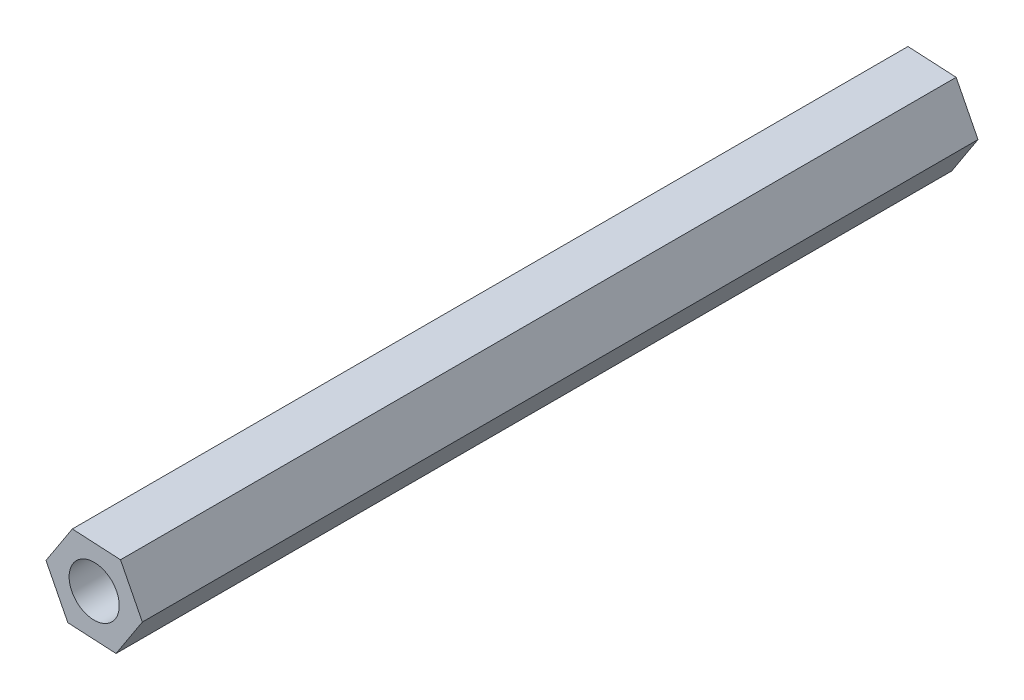
ISO-10303-21;
HEADER;
FILE_DESCRIPTION(('STEP AP214'),'2;1');
FILE_NAME('part.step','',(''),(''),'','','');
FILE_SCHEMA(('AUTOMOTIVE_DESIGN { 1 0 10303 214 1 1 1 1 }'));
ENDSEC;
DATA;
#1=APPLICATION_CONTEXT('core data for automotive mechanical design processes');
#2=APPLICATION_PROTOCOL_DEFINITION('international standard','automotive_design',2000,#1);
#3=PRODUCT_CONTEXT('',#1,'mechanical');
#4=PRODUCT('Part','Part','',(#3));
#5=PRODUCT_RELATED_PRODUCT_CATEGORY('part','',(#4));
#6=PRODUCT_DEFINITION_FORMATION('','',#4);
#7=PRODUCT_DEFINITION_CONTEXT('part definition',#1,'design');
#8=PRODUCT_DEFINITION('design','',#6,#7);
#9=PRODUCT_DEFINITION_SHAPE('','',#8);
#10=(LENGTH_UNIT() NAMED_UNIT(*) SI_UNIT(.MILLI.,.METRE.));
#11=(NAMED_UNIT(*) PLANE_ANGLE_UNIT() SI_UNIT($,.RADIAN.));
#12=(NAMED_UNIT(*) SI_UNIT($,.STERADIAN.) SOLID_ANGLE_UNIT());
#13=UNCERTAINTY_MEASURE_WITH_UNIT(LENGTH_MEASURE(1.E-05),#10,'distance_accuracy_value','');
#14=(GEOMETRIC_REPRESENTATION_CONTEXT(3) GLOBAL_UNCERTAINTY_ASSIGNED_CONTEXT((#13)) GLOBAL_UNIT_ASSIGNED_CONTEXT((#10,
#11,#12)) REPRESENTATION_CONTEXT('',''));
#15=CARTESIAN_POINT('',(0.,0.,0.));
#16=DIRECTION('',(0.,0.,1.));
#17=DIRECTION('',(1.,0.,0.));
#18=AXIS2_PLACEMENT_3D('',#15,#16,#17);
#19=CARTESIAN_POINT('',(2.8825916016709,-0.154916078280261,50.));
#20=DIRECTION('',(-0.891609732350342,-0.452804687672456,0.));
#21=DIRECTION('',(0.452804687672456,-0.891609732350342,0.));
#22=AXIS2_PLACEMENT_3D('',#19,#20,#21);
#23=PLANE('',#22);
#24=DIRECTION('',(-0.452804687672456,0.891609732350342,0.));
#25=VECTOR('',#24,1.);
#26=CARTESIAN_POINT('',(2.8825916016709,-0.154916078280261,0.));
#27=LINE('',#26,#25);
#28=CARTESIAN_POINT('',(2.8825916016709,-0.154916078280261,0.));
#29=VERTEX_POINT('',#28);
#30=CARTESIAN_POINT('',(1.57545706008081,2.41893951664254,0.));
#31=VERTEX_POINT('',#30);
#32=EDGE_CURVE('E115',#29,#31,#27,.T.);
#33=ORIENTED_EDGE('',*,*,#32,.T.);
#34=DIRECTION('',(0.,0.,-1.));
#35=VECTOR('',#34,1.);
#36=CARTESIAN_POINT('',(1.57545706008081,2.41893951664254,50.));
#37=LINE('',#36,#35);
#38=CARTESIAN_POINT('',(1.57545706008081,2.41893951664254,50.));
#39=VERTEX_POINT('',#38);
#40=EDGE_CURVE('E11',#39,#31,#37,.T.);
#41=ORIENTED_EDGE('',*,*,#40,.F.);
#42=DIRECTION('',(-0.452804687672456,0.891609732350342,0.));
#43=VECTOR('',#42,1.);
#44=CARTESIAN_POINT('',(2.8825916016709,-0.154916078280261,50.));
#45=LINE('',#44,#43);
#46=CARTESIAN_POINT('',(2.8825916016709,-0.154916078280261,50.));
#47=VERTEX_POINT('',#46);
#48=EDGE_CURVE('E126',#47,#39,#45,.T.);
#49=ORIENTED_EDGE('',*,*,#48,.F.);
#50=DIRECTION('',(0.,0.,-1.));
#51=VECTOR('',#50,1.);
#52=CARTESIAN_POINT('',(2.8825916016709,-0.154916078280261,50.));
#53=LINE('',#52,#51);
#54=EDGE_CURVE('E111',#47,#29,#53,.T.);
#55=ORIENTED_EDGE('',*,*,#54,.T.);
#56=EDGE_LOOP('',(#33,#41,#49,#55));
#57=FACE_BOUND('',#56,.T.);
#58=ADVANCED_FACE('F31',(#57),#23,.F.);
#59=CARTESIAN_POINT('',(1.57545706008081,2.41893951664254,50.));
#60=DIRECTION('',(-0.0536645036981452,-0.998559022313069,0.));
#61=DIRECTION('',(0.998559022313069,-0.0536645036981453,0.));
#62=AXIS2_PLACEMENT_3D('',#59,#60,#61);
#63=PLANE('',#62);
#64=DIRECTION('',(-0.998559022313069,0.0536645036981452,0.));
#65=VECTOR('',#64,1.);
#66=CARTESIAN_POINT('',(1.57545706008081,2.41893951664254,0.));
#67=LINE('',#66,#65);
#68=CARTESIAN_POINT('',(-1.30713454159008,2.5738555949228,0.));
#69=VERTEX_POINT('',#68);
#70=EDGE_CURVE('E118',#31,#69,#67,.T.);
#71=ORIENTED_EDGE('',*,*,#70,.T.);
#72=DIRECTION('',(0.,0.,-1.));
#73=VECTOR('',#72,1.);
#74=CARTESIAN_POINT('',(-1.30713454159008,2.5738555949228,50.));
#75=LINE('',#74,#73);
#76=CARTESIAN_POINT('',(-1.30713454159008,2.5738555949228,50.));
#77=VERTEX_POINT('',#76);
#78=EDGE_CURVE('E39',#77,#69,#75,.T.);
#79=ORIENTED_EDGE('',*,*,#78,.F.);
#80=DIRECTION('',(-0.998559022313069,0.0536645036981452,0.));
#81=VECTOR('',#80,1.);
#82=CARTESIAN_POINT('',(1.57545706008081,2.41893951664254,50.));
#83=LINE('',#82,#81);
#84=EDGE_CURVE('E84',#39,#77,#83,.T.);
#85=ORIENTED_EDGE('',*,*,#84,.F.);
#86=ORIENTED_EDGE('',*,*,#40,.T.);
#87=EDGE_LOOP('',(#71,#79,#85,#86));
#88=FACE_BOUND('',#87,.T.);
#89=ADVANCED_FACE('F151',(#88),#63,.F.);
#90=CARTESIAN_POINT('',(-1.30713454159008,2.5738555949228,50.));
#91=DIRECTION('',(0.837945228652197,-0.545754334640612,0.));
#92=DIRECTION('',(0.545754334640612,0.837945228652197,0.));
#93=AXIS2_PLACEMENT_3D('',#90,#91,#92);
#94=PLANE('',#93);
#95=DIRECTION('',(-0.545754334640612,-0.837945228652197,0.));
#96=VECTOR('',#95,1.);
#97=CARTESIAN_POINT('',(-1.30713454159008,2.5738555949228,0.));
#98=LINE('',#97,#96);
#99=CARTESIAN_POINT('',(-2.88259160167089,0.154916078280261,0.));
#100=VERTEX_POINT('',#99);
#101=EDGE_CURVE('E121',#69,#100,#98,.T.);
#102=ORIENTED_EDGE('',*,*,#101,.T.);
#103=DIRECTION('',(0.,0.,-1.));
#104=VECTOR('',#103,1.);
#105=CARTESIAN_POINT('',(-2.88259160167089,0.154916078280261,50.));
#106=LINE('',#105,#104);
#107=CARTESIAN_POINT('',(-2.88259160167089,0.154916078280261,50.));
#108=VERTEX_POINT('',#107);
#109=EDGE_CURVE('E106',#108,#100,#106,.T.);
#110=ORIENTED_EDGE('',*,*,#109,.F.);
#111=DIRECTION('',(-0.545754334640612,-0.837945228652197,0.));
#112=VECTOR('',#111,1.);
#113=CARTESIAN_POINT('',(-1.30713454159008,2.5738555949228,50.));
#114=LINE('',#113,#112);
#115=EDGE_CURVE('E97',#77,#108,#114,.T.);
#116=ORIENTED_EDGE('',*,*,#115,.F.);
#117=ORIENTED_EDGE('',*,*,#78,.T.);
#118=EDGE_LOOP('',(#102,#110,#116,#117));
#119=FACE_BOUND('',#118,.T.);
#120=ADVANCED_FACE('F132',(#119),#94,.F.);
#121=CARTESIAN_POINT('',(-2.88259160167089,0.154916078280261,50.));
#122=DIRECTION('',(0.891609732350343,0.452804687672456,0.));
#123=DIRECTION('',(-0.452804687672456,0.891609732350343,0.));
#124=AXIS2_PLACEMENT_3D('',#121,#122,#123);
#125=PLANE('',#124);
#126=DIRECTION('',(0.452804687672456,-0.891609732350343,0.));
#127=VECTOR('',#126,1.);
#128=CARTESIAN_POINT('',(-2.88259160167089,0.154916078280261,0.));
#129=LINE('',#128,#127);
#130=CARTESIAN_POINT('',(-1.57545706008081,-2.41893951664254,0.));
#131=VERTEX_POINT('',#130);
#132=EDGE_CURVE('E105',#100,#131,#129,.T.);
#133=ORIENTED_EDGE('',*,*,#132,.T.);
#134=DIRECTION('',(0.,0.,-1.));
#135=VECTOR('',#134,1.);
#136=CARTESIAN_POINT('',(-1.57545706008081,-2.41893951664254,50.));
#137=LINE('',#136,#135);
#138=CARTESIAN_POINT('',(-1.57545706008081,-2.41893951664254,50.));
#139=VERTEX_POINT('',#138);
#140=EDGE_CURVE('E102',#139,#131,#137,.T.);
#141=ORIENTED_EDGE('',*,*,#140,.F.);
#142=DIRECTION('',(0.452804687672456,-0.891609732350343,0.));
#143=VECTOR('',#142,1.);
#144=CARTESIAN_POINT('',(-2.88259160167089,0.154916078280261,50.));
#145=LINE('',#144,#143);
#146=EDGE_CURVE('E91',#108,#139,#145,.T.);
#147=ORIENTED_EDGE('',*,*,#146,.F.);
#148=ORIENTED_EDGE('',*,*,#109,.T.);
#149=EDGE_LOOP('',(#133,#141,#147,#148));
#150=FACE_BOUND('',#149,.T.);
#151=ADVANCED_FACE('F103',(#150),#125,.F.);
#152=CARTESIAN_POINT('',(-1.57545706008081,-2.41893951664254,50.));
#153=DIRECTION('',(0.0536645036981452,0.998559022313069,0.));
#154=DIRECTION('',(-0.998559022313069,0.0536645036981452,0.));
#155=AXIS2_PLACEMENT_3D('',#152,#153,#154);
#156=PLANE('',#155);
#157=DIRECTION('',(0.998559022313069,-0.0536645036981452,0.));
#158=VECTOR('',#157,1.);
#159=CARTESIAN_POINT('',(-1.57545706008081,-2.41893951664254,0.));
#160=LINE('',#159,#158);
#161=CARTESIAN_POINT('',(1.30713454159009,-2.5738555949228,0.));
#162=VERTEX_POINT('',#161);
#163=EDGE_CURVE('E70',#131,#162,#160,.T.);
#164=ORIENTED_EDGE('',*,*,#163,.T.);
#165=DIRECTION('',(0.,0.,-1.));
#166=VECTOR('',#165,1.);
#167=CARTESIAN_POINT('',(1.30713454159009,-2.5738555949228,50.));
#168=LINE('',#167,#166);
#169=CARTESIAN_POINT('',(1.30713454159009,-2.5738555949228,50.));
#170=VERTEX_POINT('',#169);
#171=EDGE_CURVE('E107',#170,#162,#168,.T.);
#172=ORIENTED_EDGE('',*,*,#171,.F.);
#173=DIRECTION('',(0.998559022313069,-0.0536645036981452,0.));
#174=VECTOR('',#173,1.);
#175=CARTESIAN_POINT('',(-1.57545706008081,-2.41893951664254,50.));
#176=LINE('',#175,#174);
#177=EDGE_CURVE('E95',#139,#170,#176,.T.);
#178=ORIENTED_EDGE('',*,*,#177,.F.);
#179=ORIENTED_EDGE('',*,*,#140,.T.);
#180=EDGE_LOOP('',(#164,#172,#178,#179));
#181=FACE_BOUND('',#180,.T.);
#182=ADVANCED_FACE('F109',(#181),#156,.F.);
#183=CARTESIAN_POINT('',(1.30713454159009,-2.5738555949228,50.));
#184=DIRECTION('',(-0.837945228652197,0.545754334640612,0.));
#185=DIRECTION('',(-0.545754334640612,-0.837945228652197,0.));
#186=AXIS2_PLACEMENT_3D('',#183,#184,#185);
#187=PLANE('',#186);
#188=DIRECTION('',(0.545754334640612,0.837945228652197,0.));
#189=VECTOR('',#188,1.);
#190=CARTESIAN_POINT('',(1.30713454159009,-2.5738555949228,0.));
#191=LINE('',#190,#189);
#192=EDGE_CURVE('E76',#162,#29,#191,.T.);
#193=ORIENTED_EDGE('',*,*,#192,.T.);
#194=ORIENTED_EDGE('',*,*,#54,.F.);
#195=DIRECTION('',(0.545754334640612,0.837945228652197,0.));
#196=VECTOR('',#195,1.);
#197=CARTESIAN_POINT('',(1.30713454159009,-2.5738555949228,50.));
#198=LINE('',#197,#196);
#199=EDGE_CURVE('E47',#170,#47,#198,.T.);
#200=ORIENTED_EDGE('',*,*,#199,.F.);
#201=ORIENTED_EDGE('',*,*,#171,.T.);
#202=EDGE_LOOP('',(#193,#194,#200,#201));
#203=FACE_BOUND('',#202,.T.);
#204=ADVANCED_FACE('F139',(#203),#187,.F.);
#205=CARTESIAN_POINT('',(1.57545706008081,2.41893951664254,50.));
#206=DIRECTION('',(0.,0.,1.));
#207=DIRECTION('',(1.,0.,0.));
#208=AXIS2_PLACEMENT_3D('',#205,#206,#207);
#209=PLANE('',#208);
#210=CARTESIAN_POINT('',(0.,0.,50.));
#211=DIRECTION('',(0.,0.,-1.));
#212=DIRECTION('',(-1.,0.,0.));
#213=AXIS2_PLACEMENT_3D('',#210,#211,#212);
#214=CIRCLE('',#213,1.5);
#215=CARTESIAN_POINT('',(-1.5,0.,50.));
#216=VERTEX_POINT('',#215);
#217=EDGE_CURVE('E119',#216,#216,#214,.T.);
#218=ORIENTED_EDGE('',*,*,#217,.T.);
#219=EDGE_LOOP('',(#218));
#220=FACE_BOUND('',#219,.T.);
#221=ORIENTED_EDGE('',*,*,#48,.T.);
#222=ORIENTED_EDGE('',*,*,#84,.T.);
#223=ORIENTED_EDGE('',*,*,#115,.T.);
#224=ORIENTED_EDGE('',*,*,#146,.T.);
#225=ORIENTED_EDGE('',*,*,#177,.T.);
#226=ORIENTED_EDGE('',*,*,#199,.T.);
#227=EDGE_LOOP('',(#221,#222,#223,#224,#225,#226));
#228=FACE_BOUND('',#227,.T.);
#229=ADVANCED_FACE('F93',(#220,#228),#209,.T.);
#230=CARTESIAN_POINT('',(1.57545706008081,2.41893951664254,0.));
#231=DIRECTION('',(0.,0.,1.));
#232=DIRECTION('',(1.,0.,0.));
#233=AXIS2_PLACEMENT_3D('',#230,#231,#232);
#234=PLANE('',#233);
#235=CARTESIAN_POINT('',(0.,0.,0.));
#236=DIRECTION('',(0.,0.,-1.));
#237=DIRECTION('',(-1.,0.,0.));
#238=AXIS2_PLACEMENT_3D('',#235,#236,#237);
#239=CIRCLE('',#238,1.5);
#240=CARTESIAN_POINT('',(-1.5,0.,0.));
#241=VERTEX_POINT('',#240);
#242=EDGE_CURVE('E206',#241,#241,#239,.T.);
#243=ORIENTED_EDGE('',*,*,#242,.F.);
#244=EDGE_LOOP('',(#243));
#245=FACE_BOUND('',#244,.T.);
#246=ORIENTED_EDGE('',*,*,#32,.F.);
#247=ORIENTED_EDGE('',*,*,#192,.F.);
#248=ORIENTED_EDGE('',*,*,#163,.F.);
#249=ORIENTED_EDGE('',*,*,#132,.F.);
#250=ORIENTED_EDGE('',*,*,#101,.F.);
#251=ORIENTED_EDGE('',*,*,#70,.F.);
#252=EDGE_LOOP('',(#246,#247,#248,#249,#250,#251));
#253=FACE_BOUND('',#252,.T.);
#254=ADVANCED_FACE('F135',(#245,#253),#234,.F.);
#255=CARTESIAN_POINT('',(0.,0.,50.));
#256=DIRECTION('',(0.,0.,-1.));
#257=DIRECTION('',(-1.,0.,0.));
#258=AXIS2_PLACEMENT_3D('',#255,#256,#257);
#259=CYLINDRICAL_SURFACE('',#258,1.5);
#260=ORIENTED_EDGE('',*,*,#217,.F.);
#261=EDGE_LOOP('',(#260));
#262=FACE_BOUND('',#261,.T.);
#263=ORIENTED_EDGE('',*,*,#242,.T.);
#264=EDGE_LOOP('',(#263));
#265=FACE_BOUND('',#264,.T.);
#266=ADVANCED_FACE('F188',(#262,#265),#259,.F.);
#267=CLOSED_SHELL('',(#58,#89,#120,#151,#182,#204,#229,#254,#266));
#268=MANIFOLD_SOLID_BREP('B2',#267);
#269=ADVANCED_BREP_SHAPE_REPRESENTATION('',(#18,#268),#14);
#270=SHAPE_DEFINITION_REPRESENTATION(#9,#269);
ENDSEC;
END-ISO-10303-21;
